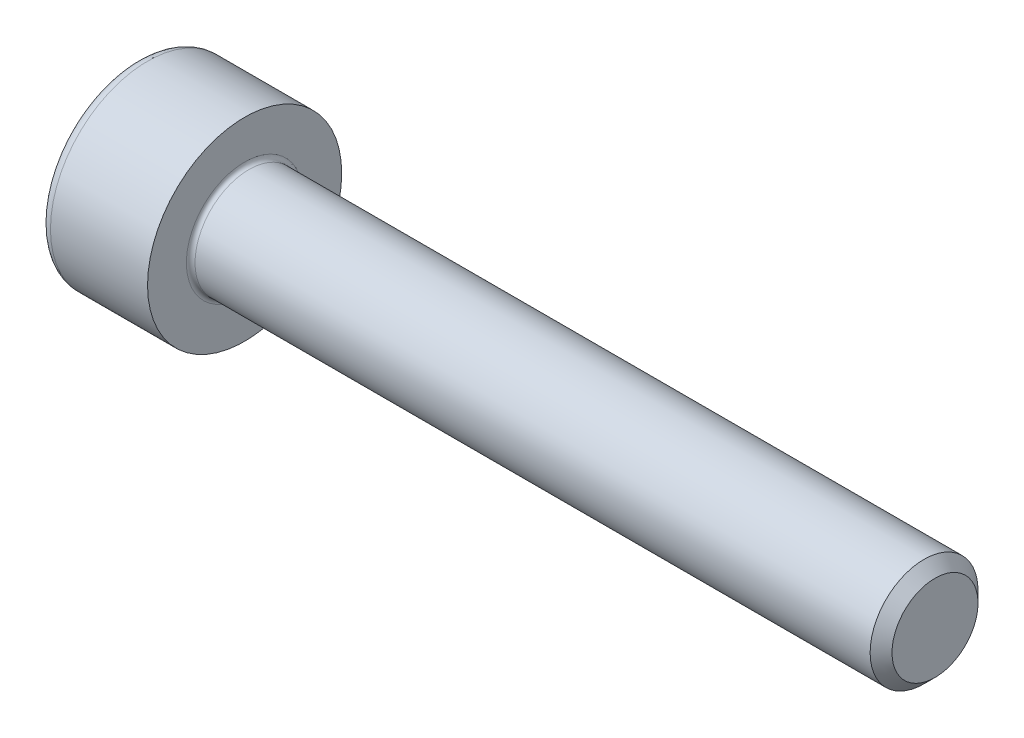
ISO-10303-21;
HEADER;
FILE_DESCRIPTION(('STEP AP214'),'2;1');
FILE_NAME('part.step','',(''),(''),'','','');
FILE_SCHEMA(('AUTOMOTIVE_DESIGN { 1 0 10303 214 1 1 1 1 }'));
ENDSEC;
DATA;
#1=APPLICATION_CONTEXT('core data for automotive mechanical design processes');
#2=APPLICATION_PROTOCOL_DEFINITION('international standard','automotive_design',2000,#1);
#3=PRODUCT_CONTEXT('',#1,'mechanical');
#4=PRODUCT('Part','Part','',(#3));
#5=PRODUCT_RELATED_PRODUCT_CATEGORY('part','',(#4));
#6=PRODUCT_DEFINITION_FORMATION('','',#4);
#7=PRODUCT_DEFINITION_CONTEXT('part definition',#1,'design');
#8=PRODUCT_DEFINITION('design','',#6,#7);
#9=PRODUCT_DEFINITION_SHAPE('','',#8);
#10=(LENGTH_UNIT() NAMED_UNIT(*) SI_UNIT(.MILLI.,.METRE.));
#11=(NAMED_UNIT(*) PLANE_ANGLE_UNIT() SI_UNIT($,.RADIAN.));
#12=(NAMED_UNIT(*) SI_UNIT($,.STERADIAN.) SOLID_ANGLE_UNIT());
#13=UNCERTAINTY_MEASURE_WITH_UNIT(LENGTH_MEASURE(1.E-05),#10,'distance_accuracy_value','');
#14=(GEOMETRIC_REPRESENTATION_CONTEXT(3) GLOBAL_UNCERTAINTY_ASSIGNED_CONTEXT((#13)) GLOBAL_UNIT_ASSIGNED_CONTEXT((#10,
#11,#12)) REPRESENTATION_CONTEXT('',''));
#15=CARTESIAN_POINT('',(0.,0.,0.));
#16=DIRECTION('',(0.,0.,1.));
#17=DIRECTION('',(1.,0.,0.));
#18=AXIS2_PLACEMENT_3D('',#15,#16,#17);
#19=CARTESIAN_POINT('',(0.,0.,0.));
#20=DIRECTION('',(-1.,0.,0.));
#21=DIRECTION('',(0.,0.,1.));
#22=AXIS2_PLACEMENT_3D('',#19,#20,#21);
#23=PLANE('',#22);
#24=DIRECTION('',(0.,-0.499999999999998,0.866025403784439));
#25=VECTOR('',#24,1.);
#26=CARTESIAN_POINT('',(0.,1.16624754376304,0.));
#27=LINE('',#26,#25);
#28=CARTESIAN_POINT('',(0.,1.16624754376304,0.));
#29=VERTEX_POINT('',#28);
#30=CARTESIAN_POINT('',(0.,0.583123771881518,1.01));
#31=VERTEX_POINT('',#30);
#32=EDGE_CURVE('E262',#29,#31,#27,.T.);
#33=ORIENTED_EDGE('',*,*,#32,.T.);
#34=DIRECTION('',(0.,1.,0.));
#35=VECTOR('',#34,1.);
#36=CARTESIAN_POINT('',(0.,-0.583123771881525,1.01));
#37=LINE('',#36,#35);
#38=CARTESIAN_POINT('',(0.,-0.583123771881525,1.01));
#39=VERTEX_POINT('',#38);
#40=EDGE_CURVE('E134',#39,#31,#37,.T.);
#41=ORIENTED_EDGE('',*,*,#40,.F.);
#42=DIRECTION('',(0.,-0.500000000000001,-0.866025403784438));
#43=VECTOR('',#42,1.);
#44=CARTESIAN_POINT('',(0.,-0.583123771881525,1.01));
#45=LINE('',#44,#43);
#46=CARTESIAN_POINT('',(0.,-1.16624754376305,0.));
#47=VERTEX_POINT('',#46);
#48=EDGE_CURVE('E265',#39,#47,#45,.T.);
#49=ORIENTED_EDGE('',*,*,#48,.T.);
#50=DIRECTION('',(0.,0.499999999999998,-0.86602540378444));
#51=VECTOR('',#50,1.);
#52=CARTESIAN_POINT('',(0.,-1.16624754376305,0.));
#53=LINE('',#52,#51);
#54=CARTESIAN_POINT('',(0.,-0.583123771881529,-1.01));
#55=VERTEX_POINT('',#54);
#56=EDGE_CURVE('E268',#47,#55,#53,.T.);
#57=ORIENTED_EDGE('',*,*,#56,.T.);
#58=DIRECTION('',(0.,-1.,0.));
#59=VECTOR('',#58,1.);
#60=CARTESIAN_POINT('',(0.,0.583123771881515,-1.01));
#61=LINE('',#60,#59);
#62=CARTESIAN_POINT('',(0.,0.583123771881515,-1.01));
#63=VERTEX_POINT('',#62);
#64=EDGE_CURVE('E271',#63,#55,#61,.T.);
#65=ORIENTED_EDGE('',*,*,#64,.F.);
#66=DIRECTION('',(0.,-0.500000000000001,-0.866025403784438));
#67=VECTOR('',#66,1.);
#68=CARTESIAN_POINT('',(0.,1.16624754376304,0.));
#69=LINE('',#68,#67);
#70=EDGE_CURVE('E129',#29,#63,#69,.T.);
#71=ORIENTED_EDGE('',*,*,#70,.F.);
#72=EDGE_LOOP('',(#33,#41,#49,#57,#65,#71));
#73=FACE_BOUND('',#72,.T.);
#74=CARTESIAN_POINT('',(0.,0.,0.));
#75=DIRECTION('',(-1.,0.,0.));
#76=DIRECTION('',(0.,0.,1.));
#77=AXIS2_PLACEMENT_3D('',#74,#75,#76);
#78=CIRCLE('',#77,2.);
#79=CARTESIAN_POINT('',(0.,0.,2.));
#80=VERTEX_POINT('',#79);
#81=EDGE_CURVE('E46',#80,#80,#78,.T.);
#82=ORIENTED_EDGE('',*,*,#81,.T.);
#83=EDGE_LOOP('',(#82));
#84=FACE_BOUND('',#83,.T.);
#85=ADVANCED_FACE('F38',(#73,#84),#23,.T.);
#86=CARTESIAN_POINT('',(-31.75,0.,0.));
#87=DIRECTION('',(-1.,0.,0.));
#88=DIRECTION('',(0.,0.,1.));
#89=AXIS2_PLACEMENT_3D('',#86,#87,#88);
#90=CYLINDRICAL_SURFACE('',#89,2.25);
#91=CARTESIAN_POINT('',(0.25,0.,0.));
#92=DIRECTION('',(-1.,0.,0.));
#93=DIRECTION('',(0.,0.,1.));
#94=AXIS2_PLACEMENT_3D('',#91,#92,#93);
#95=CIRCLE('',#94,2.25);
#96=CARTESIAN_POINT('',(0.25,0.,2.25));
#97=VERTEX_POINT('',#96);
#98=EDGE_CURVE('E11',#97,#97,#95,.F.);
#99=ORIENTED_EDGE('',*,*,#98,.T.);
#100=EDGE_LOOP('',(#99));
#101=FACE_BOUND('',#100,.T.);
#102=CARTESIAN_POINT('',(2.5,0.,0.));
#103=DIRECTION('',(-1.,0.,0.));
#104=DIRECTION('',(0.,0.,1.));
#105=AXIS2_PLACEMENT_3D('',#102,#103,#104);
#106=CIRCLE('',#105,2.25);
#107=CARTESIAN_POINT('',(2.5,0.,2.25));
#108=VERTEX_POINT('',#107);
#109=EDGE_CURVE('E152',#108,#108,#106,.T.);
#110=ORIENTED_EDGE('',*,*,#109,.T.);
#111=EDGE_LOOP('',(#110));
#112=FACE_BOUND('',#111,.T.);
#113=ADVANCED_FACE('F176',(#101,#112),#90,.T.);
#114=CARTESIAN_POINT('',(2.5,2.25,0.));
#115=DIRECTION('',(1.,0.,0.));
#116=DIRECTION('',(0.,0.,-1.));
#117=AXIS2_PLACEMENT_3D('',#114,#115,#116);
#118=PLANE('',#117);
#119=CARTESIAN_POINT('',(2.5,0.,0.));
#120=DIRECTION('',(1.,0.,0.));
#121=DIRECTION('',(0.,0.,-1.));
#122=AXIS2_PLACEMENT_3D('',#119,#120,#121);
#123=CIRCLE('',#122,1.35);
#124=CARTESIAN_POINT('',(2.5,0.,-1.35));
#125=VERTEX_POINT('',#124);
#126=EDGE_CURVE('E155',#125,#125,#123,.F.);
#127=ORIENTED_EDGE('',*,*,#126,.T.);
#128=EDGE_LOOP('',(#127));
#129=FACE_BOUND('',#128,.T.);
#130=ORIENTED_EDGE('',*,*,#109,.F.);
#131=EDGE_LOOP('',(#130));
#132=FACE_BOUND('',#131,.T.);
#133=ADVANCED_FACE('F182',(#129,#132),#118,.T.);
#134=CARTESIAN_POINT('',(-31.75,0.,0.));
#135=DIRECTION('',(-1.,0.,0.));
#136=DIRECTION('',(0.,0.,1.));
#137=AXIS2_PLACEMENT_3D('',#134,#135,#136);
#138=CYLINDRICAL_SURFACE('',#137,1.25);
#139=CARTESIAN_POINT('',(2.6,0.,0.));
#140=DIRECTION('',(1.,0.,0.));
#141=DIRECTION('',(0.,0.,-1.));
#142=AXIS2_PLACEMENT_3D('',#139,#140,#141);
#143=CIRCLE('',#142,1.25);
#144=CARTESIAN_POINT('',(2.6,0.,-1.25));
#145=VERTEX_POINT('',#144);
#146=EDGE_CURVE('E158',#145,#145,#143,.T.);
#147=ORIENTED_EDGE('',*,*,#146,.T.);
#148=EDGE_LOOP('',(#147));
#149=FACE_BOUND('',#148,.T.);
#150=CARTESIAN_POINT('',(18.2465,0.,0.));
#151=DIRECTION('',(-1.,0.,0.));
#152=DIRECTION('',(0.,0.,1.));
#153=AXIS2_PLACEMENT_3D('',#150,#151,#152);
#154=CIRCLE('',#153,1.25);
#155=CARTESIAN_POINT('',(18.2465,0.,1.25));
#156=VERTEX_POINT('',#155);
#157=EDGE_CURVE('E149',#156,#156,#154,.T.);
#158=ORIENTED_EDGE('',*,*,#157,.T.);
#159=EDGE_LOOP('',(#158));
#160=FACE_BOUND('',#159,.T.);
#161=ADVANCED_FACE('F188',(#149,#160),#138,.T.);
#162=CARTESIAN_POINT('',(18.5,0.,0.));
#163=DIRECTION('',(-1.,0.,0.));
#164=DIRECTION('',(0.,0.,1.));
#165=AXIS2_PLACEMENT_3D('',#162,#163,#164);
#166=CONICAL_SURFACE('',#165,0.9965,0.785398163397441);
#167=ORIENTED_EDGE('',*,*,#157,.F.);
#168=EDGE_LOOP('',(#167));
#169=FACE_BOUND('',#168,.T.);
#170=CARTESIAN_POINT('',(18.5,0.,0.));
#171=DIRECTION('',(-1.,0.,0.));
#172=DIRECTION('',(0.,0.,1.));
#173=AXIS2_PLACEMENT_3D('',#170,#171,#172);
#174=CIRCLE('',#173,0.9965);
#175=CARTESIAN_POINT('',(18.5,0.,0.9965));
#176=VERTEX_POINT('',#175);
#177=EDGE_CURVE('E145',#176,#176,#174,.T.);
#178=ORIENTED_EDGE('',*,*,#177,.T.);
#179=EDGE_LOOP('',(#178));
#180=FACE_BOUND('',#179,.T.);
#181=ADVANCED_FACE('F192',(#169,#180),#166,.T.);
#182=CARTESIAN_POINT('',(18.5,0.9965,0.));
#183=DIRECTION('',(1.,0.,0.));
#184=DIRECTION('',(0.,0.,-1.));
#185=AXIS2_PLACEMENT_3D('',#182,#183,#184);
#186=PLANE('',#185);
#187=ORIENTED_EDGE('',*,*,#177,.F.);
#188=EDGE_LOOP('',(#187));
#189=FACE_BOUND('',#188,.T.);
#190=ADVANCED_FACE('F172',(#189),#186,.T.);
#191=CARTESIAN_POINT('',(2.6,0.,0.));
#192=DIRECTION('',(1.,0.,0.));
#193=DIRECTION('',(0.,0.,-1.));
#194=AXIS2_PLACEMENT_3D('',#191,#192,#193);
#195=TOROIDAL_SURFACE('',#194,1.35,0.1);
#196=ORIENTED_EDGE('',*,*,#146,.F.);
#197=EDGE_LOOP('',(#196));
#198=FACE_BOUND('',#197,.T.);
#199=ORIENTED_EDGE('',*,*,#126,.F.);
#200=EDGE_LOOP('',(#199));
#201=FACE_BOUND('',#200,.T.);
#202=ADVANCED_FACE('F165',(#198,#201),#195,.F.);
#203=CARTESIAN_POINT('',(0.25,0.,0.));
#204=DIRECTION('',(-1.,0.,0.));
#205=DIRECTION('',(0.,0.,1.));
#206=AXIS2_PLACEMENT_3D('',#203,#204,#205);
#207=TOROIDAL_SURFACE('',#206,2.,0.25);
#208=ORIENTED_EDGE('',*,*,#98,.F.);
#209=EDGE_LOOP('',(#208));
#210=FACE_BOUND('',#209,.T.);
#211=ORIENTED_EDGE('',*,*,#81,.F.);
#212=EDGE_LOOP('',(#211));
#213=FACE_BOUND('',#212,.T.);
#214=ADVANCED_FACE('F40',(#210,#213),#207,.T.);
#215=CARTESIAN_POINT('',(1.1,1.16624754376304,0.));
#216=DIRECTION('',(0.,-0.86602540378444,-0.499999999999998));
#217=DIRECTION('',(0.,0.499999999999998,-0.86602540378444));
#218=AXIS2_PLACEMENT_3D('',#215,#216,#217);
#219=PLANE('',#218);
#220=ORIENTED_EDGE('',*,*,#32,.F.);
#221=DIRECTION('',(-1.,0.,0.));
#222=VECTOR('',#221,1.);
#223=CARTESIAN_POINT('',(1.1,1.16624754376304,0.));
#224=LINE('',#223,#222);
#225=CARTESIAN_POINT('',(1.1,1.16624754376304,0.));
#226=VERTEX_POINT('',#225);
#227=EDGE_CURVE('E252',#226,#29,#224,.T.);
#228=ORIENTED_EDGE('',*,*,#227,.F.);
#229=DIRECTION('',(0.,-0.499999999999998,0.866025403784439));
#230=VECTOR('',#229,1.);
#231=CARTESIAN_POINT('',(1.1,1.16624754376304,0.));
#232=LINE('',#231,#230);
#233=CARTESIAN_POINT('',(1.1,0.874685657822279,0.504999999999995));
#234=VERTEX_POINT('',#233);
#235=EDGE_CURVE('E121',#226,#234,#232,.T.);
#236=ORIENTED_EDGE('',*,*,#235,.T.);
#237=CARTESIAN_POINT('',(1.1,0.583123771881518,1.01));
#238=VERTEX_POINT('',#237);
#239=EDGE_CURVE('E112',#234,#238,#232,.T.);
#240=ORIENTED_EDGE('',*,*,#239,.T.);
#241=DIRECTION('',(-1.,0.,0.));
#242=VECTOR('',#241,1.);
#243=CARTESIAN_POINT('',(1.1,0.583123771881518,1.01));
#244=LINE('',#243,#242);
#245=EDGE_CURVE('E126',#238,#31,#244,.T.);
#246=ORIENTED_EDGE('',*,*,#245,.T.);
#247=EDGE_LOOP('',(#220,#228,#236,#240,#246));
#248=FACE_BOUND('',#247,.T.);
#249=ADVANCED_FACE('F125',(#248),#219,.T.);
#250=CARTESIAN_POINT('',(1.1,-0.583123771881525,1.01));
#251=DIRECTION('',(0.,0.,1.));
#252=DIRECTION('',(0.,-1.,0.));
#253=AXIS2_PLACEMENT_3D('',#250,#251,#252);
#254=PLANE('',#253);
#255=ORIENTED_EDGE('',*,*,#40,.T.);
#256=ORIENTED_EDGE('',*,*,#245,.F.);
#257=DIRECTION('',(0.,1.,0.));
#258=VECTOR('',#257,1.);
#259=CARTESIAN_POINT('',(1.1,-0.583123771881525,1.01));
#260=LINE('',#259,#258);
#261=CARTESIAN_POINT('',(1.1,0.,1.01));
#262=VERTEX_POINT('',#261);
#263=EDGE_CURVE('E109',#262,#238,#260,.T.);
#264=ORIENTED_EDGE('',*,*,#263,.F.);
#265=CARTESIAN_POINT('',(1.1,-0.583123771881525,1.01));
#266=VERTEX_POINT('',#265);
#267=EDGE_CURVE('E120',#266,#262,#260,.T.);
#268=ORIENTED_EDGE('',*,*,#267,.F.);
#269=DIRECTION('',(-1.,0.,0.));
#270=VECTOR('',#269,1.);
#271=CARTESIAN_POINT('',(1.1,-0.583123771881525,1.01));
#272=LINE('',#271,#270);
#273=EDGE_CURVE('E136',#266,#39,#272,.T.);
#274=ORIENTED_EDGE('',*,*,#273,.T.);
#275=EDGE_LOOP('',(#255,#256,#264,#268,#274));
#276=FACE_BOUND('',#275,.T.);
#277=ADVANCED_FACE('F131',(#276),#254,.F.);
#278=CARTESIAN_POINT('',(1.1,-0.583123771881525,1.01));
#279=DIRECTION('',(0.,0.866025403784438,-0.500000000000001));
#280=DIRECTION('',(0.,0.500000000000001,0.866025403784438));
#281=AXIS2_PLACEMENT_3D('',#278,#279,#280);
#282=PLANE('',#281);
#283=ORIENTED_EDGE('',*,*,#48,.F.);
#284=ORIENTED_EDGE('',*,*,#273,.F.);
#285=DIRECTION('',(0.,-0.500000000000001,-0.866025403784438));
#286=VECTOR('',#285,1.);
#287=CARTESIAN_POINT('',(1.1,-0.583123771881525,1.01));
#288=LINE('',#287,#286);
#289=CARTESIAN_POINT('',(1.1,-0.874685657822285,0.505000000000002));
#290=VERTEX_POINT('',#289);
#291=EDGE_CURVE('E291',#266,#290,#288,.T.);
#292=ORIENTED_EDGE('',*,*,#291,.T.);
#293=CARTESIAN_POINT('',(1.1,-1.16624754376305,0.));
#294=VERTEX_POINT('',#293);
#295=EDGE_CURVE('E280',#290,#294,#288,.T.);
#296=ORIENTED_EDGE('',*,*,#295,.T.);
#297=DIRECTION('',(-1.,0.,0.));
#298=VECTOR('',#297,1.);
#299=CARTESIAN_POINT('',(1.1,-1.16624754376305,0.));
#300=LINE('',#299,#298);
#301=EDGE_CURVE('E141',#294,#47,#300,.T.);
#302=ORIENTED_EDGE('',*,*,#301,.T.);
#303=EDGE_LOOP('',(#283,#284,#292,#296,#302));
#304=FACE_BOUND('',#303,.T.);
#305=ADVANCED_FACE('F206',(#304),#282,.T.);
#306=CARTESIAN_POINT('',(1.1,-1.16624754376305,0.));
#307=DIRECTION('',(0.,0.86602540378444,0.499999999999998));
#308=DIRECTION('',(0.,-0.499999999999998,0.86602540378444));
#309=AXIS2_PLACEMENT_3D('',#306,#307,#308);
#310=PLANE('',#309);
#311=ORIENTED_EDGE('',*,*,#56,.F.);
#312=ORIENTED_EDGE('',*,*,#301,.F.);
#313=DIRECTION('',(0.,0.499999999999998,-0.86602540378444));
#314=VECTOR('',#313,1.);
#315=CARTESIAN_POINT('',(1.1,-1.16624754376305,0.));
#316=LINE('',#315,#314);
#317=CARTESIAN_POINT('',(1.1,-0.874685657822289,-0.505000000000001));
#318=VERTEX_POINT('',#317);
#319=EDGE_CURVE('E258',#294,#318,#316,.T.);
#320=ORIENTED_EDGE('',*,*,#319,.T.);
#321=CARTESIAN_POINT('',(1.1,-0.583123771881529,-1.01));
#322=VERTEX_POINT('',#321);
#323=EDGE_CURVE('E290',#318,#322,#316,.T.);
#324=ORIENTED_EDGE('',*,*,#323,.T.);
#325=DIRECTION('',(-1.,0.,0.));
#326=VECTOR('',#325,1.);
#327=CARTESIAN_POINT('',(1.1,-0.583123771881529,-1.01));
#328=LINE('',#327,#326);
#329=EDGE_CURVE('E251',#322,#55,#328,.T.);
#330=ORIENTED_EDGE('',*,*,#329,.T.);
#331=EDGE_LOOP('',(#311,#312,#320,#324,#330));
#332=FACE_BOUND('',#331,.T.);
#333=ADVANCED_FACE('F209',(#332),#310,.T.);
#334=CARTESIAN_POINT('',(1.1,0.583123771881515,-1.01));
#335=DIRECTION('',(0.,0.,-1.));
#336=DIRECTION('',(0.,1.,0.));
#337=AXIS2_PLACEMENT_3D('',#334,#335,#336);
#338=PLANE('',#337);
#339=ORIENTED_EDGE('',*,*,#64,.T.);
#340=ORIENTED_EDGE('',*,*,#329,.F.);
#341=DIRECTION('',(0.,-1.,0.));
#342=VECTOR('',#341,1.);
#343=CARTESIAN_POINT('',(1.1,0.583123771881515,-1.01));
#344=LINE('',#343,#342);
#345=CARTESIAN_POINT('',(1.1,0.,-1.01));
#346=VERTEX_POINT('',#345);
#347=EDGE_CURVE('E255',#346,#322,#344,.T.);
#348=ORIENTED_EDGE('',*,*,#347,.F.);
#349=CARTESIAN_POINT('',(1.1,0.583123771881515,-1.01));
#350=VERTEX_POINT('',#349);
#351=EDGE_CURVE('E53',#350,#346,#344,.T.);
#352=ORIENTED_EDGE('',*,*,#351,.F.);
#353=DIRECTION('',(-1.,0.,0.));
#354=VECTOR('',#353,1.);
#355=CARTESIAN_POINT('',(1.1,0.583123771881515,-1.01));
#356=LINE('',#355,#354);
#357=EDGE_CURVE('E248',#350,#63,#356,.T.);
#358=ORIENTED_EDGE('',*,*,#357,.T.);
#359=EDGE_LOOP('',(#339,#340,#348,#352,#358));
#360=FACE_BOUND('',#359,.T.);
#361=ADVANCED_FACE('F213',(#360),#338,.F.);
#362=CARTESIAN_POINT('',(1.1,1.16624754376304,0.));
#363=DIRECTION('',(0.,0.866025403784438,-0.500000000000001));
#364=DIRECTION('',(0.,0.500000000000001,0.866025403784438));
#365=AXIS2_PLACEMENT_3D('',#362,#363,#364);
#366=PLANE('',#365);
#367=ORIENTED_EDGE('',*,*,#70,.T.);
#368=ORIENTED_EDGE('',*,*,#357,.F.);
#369=DIRECTION('',(0.,-0.500000000000001,-0.866025403784438));
#370=VECTOR('',#369,1.);
#371=CARTESIAN_POINT('',(1.1,1.16624754376304,0.));
#372=LINE('',#371,#370);
#373=CARTESIAN_POINT('',(1.1,0.874685657822279,-0.504999999999999));
#374=VERTEX_POINT('',#373);
#375=EDGE_CURVE('E238',#374,#350,#372,.T.);
#376=ORIENTED_EDGE('',*,*,#375,.F.);
#377=EDGE_CURVE('E244',#226,#374,#372,.T.);
#378=ORIENTED_EDGE('',*,*,#377,.F.);
#379=ORIENTED_EDGE('',*,*,#227,.T.);
#380=EDGE_LOOP('',(#367,#368,#376,#378,#379));
#381=FACE_BOUND('',#380,.T.);
#382=ADVANCED_FACE('F217',(#381),#366,.F.);
#383=CARTESIAN_POINT('',(1.1,1.74937131564456,-1.01));
#384=DIRECTION('',(1.,0.,0.));
#385=DIRECTION('',(0.,0.,-1.));
#386=AXIS2_PLACEMENT_3D('',#383,#384,#385);
#387=PLANE('',#386);
#388=ORIENTED_EDGE('',*,*,#347,.T.);
#389=ORIENTED_EDGE('',*,*,#323,.F.);
#390=CARTESIAN_POINT('',(1.1,0.,0.));
#391=DIRECTION('',(-1.,0.,0.));
#392=DIRECTION('',(0.,0.,1.));
#393=AXIS2_PLACEMENT_3D('',#390,#391,#392);
#394=CIRCLE('',#393,1.01);
#395=EDGE_CURVE('E286',#346,#318,#394,.T.);
#396=ORIENTED_EDGE('',*,*,#395,.F.);
#397=EDGE_LOOP('',(#388,#389,#396));
#398=FACE_BOUND('',#397,.T.);
#399=ADVANCED_FACE('F221',(#398),#387,.F.);
#400=ORIENTED_EDGE('',*,*,#319,.F.);
#401=ORIENTED_EDGE('',*,*,#295,.F.);
#402=EDGE_CURVE('E139',#318,#290,#394,.T.);
#403=ORIENTED_EDGE('',*,*,#402,.F.);
#404=EDGE_LOOP('',(#400,#401,#403));
#405=FACE_BOUND('',#404,.T.);
#406=ADVANCED_FACE('F224',(#405),#387,.F.);
#407=ORIENTED_EDGE('',*,*,#291,.F.);
#408=ORIENTED_EDGE('',*,*,#267,.T.);
#409=EDGE_CURVE('E135',#290,#262,#394,.T.);
#410=ORIENTED_EDGE('',*,*,#409,.F.);
#411=EDGE_LOOP('',(#407,#408,#410));
#412=FACE_BOUND('',#411,.T.);
#413=ADVANCED_FACE('F229',(#412),#387,.F.);
#414=ORIENTED_EDGE('',*,*,#263,.T.);
#415=ORIENTED_EDGE('',*,*,#239,.F.);
#416=EDGE_CURVE('E115',#262,#234,#394,.T.);
#417=ORIENTED_EDGE('',*,*,#416,.F.);
#418=EDGE_LOOP('',(#414,#415,#417));
#419=FACE_BOUND('',#418,.T.);
#420=ADVANCED_FACE('F111',(#419),#387,.F.);
#421=ORIENTED_EDGE('',*,*,#235,.F.);
#422=ORIENTED_EDGE('',*,*,#377,.T.);
#423=EDGE_CURVE('E146',#234,#374,#394,.T.);
#424=ORIENTED_EDGE('',*,*,#423,.F.);
#425=EDGE_LOOP('',(#421,#422,#424));
#426=FACE_BOUND('',#425,.T.);
#427=ADVANCED_FACE('F232',(#426),#387,.F.);
#428=ORIENTED_EDGE('',*,*,#375,.T.);
#429=ORIENTED_EDGE('',*,*,#351,.T.);
#430=EDGE_CURVE('E241',#374,#346,#394,.T.);
#431=ORIENTED_EDGE('',*,*,#430,.F.);
#432=EDGE_LOOP('',(#428,#429,#431));
#433=FACE_BOUND('',#432,.T.);
#434=ADVANCED_FACE('F202',(#433),#387,.F.);
#435=CARTESIAN_POINT('',(1.1,0.,0.));
#436=DIRECTION('',(-1.,0.,0.));
#437=DIRECTION('',(0.,0.,1.));
#438=AXIS2_PLACEMENT_3D('',#435,#436,#437);
#439=CONICAL_SURFACE('',#438,1.01,1.0471975511966);
#440=CARTESIAN_POINT('',(1.68312377188153,0.,0.));
#441=VERTEX_POINT('',#440);
#442=VERTEX_LOOP('',#441);
#443=FACE_BOUND('',#442,.T.);
#444=ORIENTED_EDGE('',*,*,#416,.T.);
#445=ORIENTED_EDGE('',*,*,#423,.T.);
#446=ORIENTED_EDGE('',*,*,#430,.T.);
#447=ORIENTED_EDGE('',*,*,#395,.T.);
#448=ORIENTED_EDGE('',*,*,#402,.T.);
#449=ORIENTED_EDGE('',*,*,#409,.T.);
#450=EDGE_LOOP('',(#444,#445,#446,#447,#448,#449));
#451=FACE_BOUND('',#450,.T.);
#452=ADVANCED_FACE('F200',(#443,#451),#439,.F.);
#453=CLOSED_SHELL('',(#85,#113,#133,#161,#181,#190,#202,#214,#249,#277,#305,#333,#361,#382,#399,
#406,#413,#420,#427,#434,#452));
#454=MANIFOLD_SOLID_BREP('B2',#453);
#455=ADVANCED_BREP_SHAPE_REPRESENTATION('',(#18,#454),#14);
#456=SHAPE_DEFINITION_REPRESENTATION(#9,#455);
ENDSEC;
END-ISO-10303-21;
